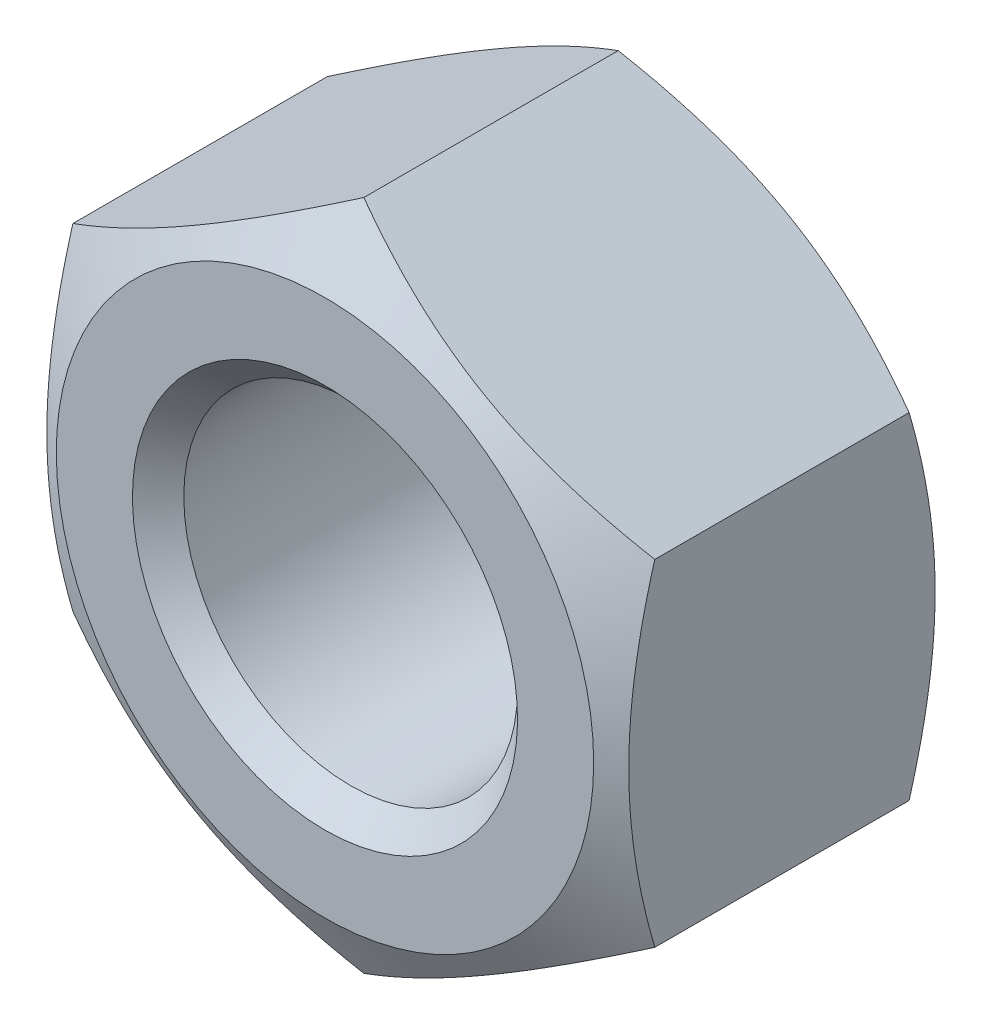
ISO-10303-21;
HEADER;
FILE_DESCRIPTION(('STEP AP214'),'2;1');
FILE_NAME('part.step','',(''),(''),'','','');
FILE_SCHEMA(('AUTOMOTIVE_DESIGN { 1 0 10303 214 1 1 1 1 }'));
ENDSEC;
DATA;
#1=APPLICATION_CONTEXT('core data for automotive mechanical design processes');
#2=APPLICATION_PROTOCOL_DEFINITION('international standard','automotive_design',2000,#1);
#3=PRODUCT_CONTEXT('',#1,'mechanical');
#4=PRODUCT('Part','Part','',(#3));
#5=PRODUCT_RELATED_PRODUCT_CATEGORY('part','',(#4));
#6=PRODUCT_DEFINITION_FORMATION('','',#4);
#7=PRODUCT_DEFINITION_CONTEXT('part definition',#1,'design');
#8=PRODUCT_DEFINITION('design','',#6,#7);
#9=PRODUCT_DEFINITION_SHAPE('','',#8);
#10=(LENGTH_UNIT() NAMED_UNIT(*) SI_UNIT(.MILLI.,.METRE.));
#11=(NAMED_UNIT(*) PLANE_ANGLE_UNIT() SI_UNIT($,.RADIAN.));
#12=(NAMED_UNIT(*) SI_UNIT($,.STERADIAN.) SOLID_ANGLE_UNIT());
#13=UNCERTAINTY_MEASURE_WITH_UNIT(LENGTH_MEASURE(1.E-05),#10,'distance_accuracy_value','');
#14=(GEOMETRIC_REPRESENTATION_CONTEXT(3) GLOBAL_UNCERTAINTY_ASSIGNED_CONTEXT((#13)) GLOBAL_UNIT_ASSIGNED_CONTEXT((#10,
#11,#12)) REPRESENTATION_CONTEXT('',''));
#15=CARTESIAN_POINT('',(0.,0.,0.));
#16=DIRECTION('',(0.,0.,1.));
#17=DIRECTION('',(1.,0.,0.));
#18=AXIS2_PLACEMENT_3D('',#15,#16,#17);
#19=CARTESIAN_POINT('',(0.,0.,0.));
#20=DIRECTION('',(0.,0.,1.));
#21=DIRECTION('',(1.,0.,0.));
#22=AXIS2_PLACEMENT_3D('',#19,#20,#21);
#23=PLANE('',#22);
#24=CARTESIAN_POINT('',(0.,0.,0.));
#25=DIRECTION('',(0.,0.,1.));
#26=DIRECTION('',(0.,-1.,0.));
#27=AXIS2_PLACEMENT_3D('',#24,#25,#26);
#28=CIRCLE('',#27,11.25);
#29=CARTESIAN_POINT('',(0.,-11.25,0.));
#30=VERTEX_POINT('',#29);
#31=EDGE_CURVE('E264',#30,#30,#28,.T.);
#32=ORIENTED_EDGE('',*,*,#31,.F.);
#33=EDGE_LOOP('',(#32));
#34=FACE_BOUND('',#33,.T.);
#35=CARTESIAN_POINT('',(0.,0.,0.));
#36=DIRECTION('',(0.,0.,1.));
#37=DIRECTION('',(1.,0.,0.));
#38=AXIS2_PLACEMENT_3D('',#35,#36,#37);
#39=CIRCLE('',#38,15.7);
#40=CARTESIAN_POINT('',(15.7,0.,0.));
#41=VERTEX_POINT('',#40);
#42=EDGE_CURVE('E223',#41,#41,#39,.T.);
#43=ORIENTED_EDGE('',*,*,#42,.T.);
#44=EDGE_LOOP('',(#43));
#45=FACE_BOUND('',#44,.T.);
#46=ADVANCED_FACE('F36',(#34,#45),#23,.T.);
#47=CARTESIAN_POINT('',(0.,0.,0.));
#48=DIRECTION('',(0.,0.,-1.));
#49=DIRECTION('',(-1.,0.,0.));
#50=AXIS2_PLACEMENT_3D('',#47,#48,#49);
#51=CONICAL_SURFACE('',#50,15.7,1.0471975511966);
#52=CARTESIAN_POINT('',(-17.0002,9.81483910616981,-2.26900077431108));
#53=CARTESIAN_POINT('',(-16.6265469064567,10.0305678203106,-2.14445819023212));
#54=CARTESIAN_POINT('',(-16.251436365233,10.2471379922619,-2.02556713985945));
#55=CARTESIAN_POINT('',(-15.4982073403609,10.6820149725333,-1.80065903466373));
#56=CARTESIAN_POINT('',(-15.1200879107272,10.9003223270181,-1.69464621406476));
#57=CARTESIAN_POINT('',(-14.3601103187305,11.3390955943355,-1.49691959430863));
#58=CARTESIAN_POINT('',(-13.9782455058022,11.5595653468737,-1.40523962826047));
#59=CARTESIAN_POINT('',(-13.2118624748498,12.0020367960964,-1.23814738869012));
#60=CARTESIAN_POINT('',(-12.8273444100892,12.2240384042942,-1.16273418351413));
#61=CARTESIAN_POINT('',(-12.0655075393886,12.6638851266718,-1.03138301007862));
#62=CARTESIAN_POINT('',(-11.6882452921721,12.8816975866573,-0.975010293167007));
#63=CARTESIAN_POINT('',(-10.9319921229911,13.3183205574595,-0.880485850052318));
#64=CARTESIAN_POINT('',(-10.5530011678939,13.5371310874053,-0.842334474574963));
#65=CARTESIAN_POINT('',(-9.79438261780434,13.9751197115118,-0.785216014403568));
#66=CARTESIAN_POINT('',(-9.41475631882947,14.1942970574164,-0.76622613300532));
#67=CARTESIAN_POINT('',(-8.65515330704035,14.6328540607501,-0.747839050498202));
#68=CARTESIAN_POINT('',(-8.27517660541659,14.8522337117183,-0.748441243980961));
#69=CARTESIAN_POINT('',(-7.56480067427073,15.2623694467912,-0.767870053870435));
#70=CARTESIAN_POINT('',(-7.23435083193736,15.4531547522161,-0.784327500506852));
#71=CARTESIAN_POINT('',(-6.57423939634649,15.8342702672496,-0.831747883297576));
#72=CARTESIAN_POINT('',(-6.2445777918682,16.0246004833366,-0.862710611714524));
#73=CARTESIAN_POINT('',(-5.58616773221974,16.4047337085118,-0.938604295800273));
#74=CARTESIAN_POINT('',(-5.25742037514752,16.5945360836128,-0.983547882986054));
#75=CARTESIAN_POINT('',(-4.60149064349035,16.9732372907546,-1.08661020340748));
#76=CARTESIAN_POINT('',(-4.27430826227985,17.1621361266206,-1.14472888081401));
#77=CARTESIAN_POINT('',(-3.281103910772,17.7355629263239,-1.34032568866998));
#78=CARTESIAN_POINT('',(-2.61795816688453,18.1184303000693,-1.4973073879878));
#79=CARTESIAN_POINT('',(-1.30155488695446,18.878456088099,-1.85359145296698));
#80=CARTESIAN_POINT('',(-0.648280497058976,19.2556242329599,-2.05281014623164));
#81=CARTESIAN_POINT('',(0.000200000000001784,19.6300246225011,-2.26900077431108));
#82=B_SPLINE_CURVE_WITH_KNOTS('',3,(#52,#53,#54,#55,#56,#57,#58,#59,#60,#61,#62,#63,#64,#65,#66,
#67,#68,#69,#70,#71,#72,#73,#74,#75,#76,#77,#78,#79,#80,#81),.UNSPECIFIED.,.F.,.F.,(4,2,2,2,2,2,
2,2,2,2,2,2,2,2,4),(0.,1.34725361023886,2.6949489909653,4.04577911356302,5.39653184888179,
6.71394507676439,8.03138366129191,9.34725301563479,10.6630817087628,11.808581597515,
12.9540650814946,14.1005865149997,15.2471030902392,17.590639246696,19.929575477219),.UNSPECIFIED.);
#83=CARTESIAN_POINT('',(-17.,9.81495457622365,-2.26893410705618));
#84=VERTEX_POINT('',#83);
#85=CARTESIAN_POINT('',(0.,19.6299091524473,-2.26893410705618));
#86=VERTEX_POINT('',#85);
#87=EDGE_CURVE('E218',#84,#86,#82,.T.);
#88=ORIENTED_EDGE('',*,*,#87,.F.);
#89=CARTESIAN_POINT('',(-17.,-25.9267472467528,-8.83528627186308));
#90=CARTESIAN_POINT('',(-17.,-25.5539648090977,-8.65530488119288));
#91=CARTESIAN_POINT('',(-17.,-25.1807288184547,-8.47626336943934));
#92=CARTESIAN_POINT('',(-17.,-24.4332538627016,-8.12027608125413));
#93=CARTESIAN_POINT('',(-17.,-24.0590148864408,-7.94333032824134));
#94=CARTESIAN_POINT('',(-17.,-22.9345384288083,-7.41590864060599));
#95=CARTESIAN_POINT('',(-17.,-22.1826644417827,-7.06890784699101));
#96=CARTESIAN_POINT('',(-17.,-20.6693295294818,-6.38442672467381));
#97=CARTESIAN_POINT('',(-17.,-19.9078382964153,-6.04701323457675));
#98=CARTESIAN_POINT('',(-17.,-18.3785592608469,-5.38682372702414));
#99=CARTESIAN_POINT('',(-17.,-17.6107717926793,-5.06404693821717));
#100=CARTESIAN_POINT('',(-17.,-16.0586340457663,-4.43340326623387));
#101=CARTESIAN_POINT('',(-17.,-15.274195004503,-4.12575369084784));
#102=CARTESIAN_POINT('',(-17.,-13.696022043621,-3.53480920182964));
#103=CARTESIAN_POINT('',(-17.,-12.9022870972841,-3.25151700781198));
#104=CARTESIAN_POINT('',(-17.,-11.3059512165511,-2.71697899718527));
#105=CARTESIAN_POINT('',(-17.,-10.5033735966652,-2.46566413029521));
#106=CARTESIAN_POINT('',(-17.,-8.88673603066168,-2.00329800631384));
#107=CARTESIAN_POINT('',(-17.,-8.07267983149313,-1.79223392262732));
#108=CARTESIAN_POINT('',(-17.,-6.84282468382309,-1.51359777047095));
#109=CARTESIAN_POINT('',(-17.,-6.43130091987701,-1.42702780561636));
#110=CARTESIAN_POINT('',(-17.,-5.60553570443179,-1.26792169073959));
#111=CARTESIAN_POINT('',(-17.,-5.19129431536871,-1.19538521946428));
#112=CARTESIAN_POINT('',(-17.,-4.36037948024351,-1.06563790696937));
#113=CARTESIAN_POINT('',(-17.,-3.94370588240015,-1.00842803287828));
#114=CARTESIAN_POINT('',(-17.,-3.10841242547604,-0.910486373547461));
#115=CARTESIAN_POINT('',(-17.,-2.68979256380067,-0.869754610281469));
#116=CARTESIAN_POINT('',(-17.,-1.85381375994843,-0.805860178374631));
#117=CARTESIAN_POINT('',(-17.,-1.43646307035987,-0.782590240303972));
#118=CARTESIAN_POINT('',(-17.,-0.601153044712188,-0.753740168759731));
#119=CARTESIAN_POINT('',(-17.,-0.183193717826098,-0.748159771384462));
#120=CARTESIAN_POINT('',(-17.,0.652471507108319,-0.754820619047691));
#121=CARTESIAN_POINT('',(-17.,1.070177443126,-0.767057044362938));
#122=CARTESIAN_POINT('',(-17.,1.90470927270493,-0.809050414750458));
#123=CARTESIAN_POINT('',(-17.,2.32153512661024,-0.838808133097964));
#124=CARTESIAN_POINT('',(-17.,3.33484820370525,-0.931831324455307));
#125=CARTESIAN_POINT('',(-17.,3.93052966291356,-1.00404527837153));
#126=CARTESIAN_POINT('',(-17.,5.11715583192569,-1.18021128874136));
#127=CARTESIAN_POINT('',(-17.,5.7080998115513,-1.28416814469026));
#128=CARTESIAN_POINT('',(-17.,7.47489110533387,-1.63843047027764));
#129=CARTESIAN_POINT('',(-17.,8.64238042158542,-1.9308880733226));
#130=CARTESIAN_POINT('',(-17.,10.3885450516742,-2.43429179450095));
#131=CARTESIAN_POINT('',(-17.,10.9763653928662,-2.61530716784065));
#132=CARTESIAN_POINT('',(-17.,12.1463268837286,-2.99516492515156));
#133=CARTESIAN_POINT('',(-17.,12.7284675203987,-3.19400890320246));
#134=CARTESIAN_POINT('',(-17.,13.8841642605752,-3.60530371093944));
#135=CARTESIAN_POINT('',(-17.,14.4577503102576,-3.81767110050551));
#136=CARTESIAN_POINT('',(-17.,15.3145292969767,-4.14530846477523));
#137=CARTESIAN_POINT('',(-17.,15.5994765967891,-4.25601670616324));
#138=CARTESIAN_POINT('',(-17.,16.1682685205824,-4.48021558039378));
#139=CARTESIAN_POINT('',(-17.,16.4521131659655,-4.59370615891639));
#140=CARTESIAN_POINT('',(-17.,16.735444987615,-4.70846199828913));
#141=B_SPLINE_CURVE_WITH_KNOTS('',3,(#89,#90,#91,#92,#93,#94,#95,#96,#97,#98,#99,#100,#101,#102,
#103,#104,#105,#106,#107,#108,#109,#110,#111,#112,#113,#114,#115,#116,#117,#118,#119,#120,#121,
#122,#123,#124,#125,#126,#127,#128,#129,#130,#131,#132,#133,#134,#135,#136,#137,#138,#139,#140),
.UNSPECIFIED.,.F.,.F.,(4,2,2,2,2,2,2,2,2,2,2,2,2,2,2,2,2,2,2,2,2,2,2,2,2,4),(0.,
1.24186727211345,2.48374840829803,4.96792071543007,7.46649146485291,9.96493038667426,
12.4924537659258,15.0202589893835,17.5425096574214,20.0639552194549,21.3253468534078,
22.5867096083098,23.8481519381283,25.1095959500881,26.3632259008802,27.6168371492864,
28.8701093396594,30.1234368454131,31.9225406006737,33.721916513448,37.3276264552829,
39.1726660852152,41.0178708474609,42.8526253217389,43.7697066959693,44.6867701801409),.UNSPECIFIED.);
#142=CARTESIAN_POINT('',(-17.,-9.81495457622364,-2.26893410705618));
#143=VERTEX_POINT('',#142);
#144=EDGE_CURVE('E186',#143,#84,#141,.T.);
#145=ORIENTED_EDGE('',*,*,#144,.F.);
#146=CARTESIAN_POINT('',(0.000199999999992894,-19.6300246225011,-2.26900077431108));
#147=CARTESIAN_POINT('',(-0.373453093543291,-19.4142959083604,-2.14445819023212));
#148=CARTESIAN_POINT('',(-0.748563634767014,-19.197725736409,-2.02556713985945));
#149=CARTESIAN_POINT('',(-1.50179265963909,-18.7628487561377,-1.80065903466373));
#150=CARTESIAN_POINT('',(-1.87991208927283,-18.5445414016528,-1.69464621406476));
#151=CARTESIAN_POINT('',(-2.63988968126951,-18.1057681343354,-1.49691959430863));
#152=CARTESIAN_POINT('',(-3.02175449419786,-17.8852983817972,-1.40523962826047));
#153=CARTESIAN_POINT('',(-3.78813752515018,-17.4428269325745,-1.23814738869012));
#154=CARTESIAN_POINT('',(-4.1726555899108,-17.2208253243767,-1.16273418351413));
#155=CARTESIAN_POINT('',(-4.93449246061139,-16.7809786019991,-1.03138301007862));
#156=CARTESIAN_POINT('',(-5.31175470782787,-16.5631661420136,-0.975010293167006));
#157=CARTESIAN_POINT('',(-6.06800787700895,-16.1265431712114,-0.880485850052319));
#158=CARTESIAN_POINT('',(-6.44699883210612,-15.9077326412656,-0.842334474574963));
#159=CARTESIAN_POINT('',(-7.20561738219567,-15.4697440171592,-0.785216014403568));
#160=CARTESIAN_POINT('',(-7.58524368117054,-15.2505666712546,-0.766226133005319));
#161=CARTESIAN_POINT('',(-8.34484669295967,-14.8120096679209,-0.747839050498201));
#162=CARTESIAN_POINT('',(-8.72482339458342,-14.5926300169526,-0.748441243980961));
#163=CARTESIAN_POINT('',(-9.43519932572928,-14.1824942818797,-0.767870053870435));
#164=CARTESIAN_POINT('',(-9.76564916806265,-13.9917089764549,-0.784327500506851));
#165=CARTESIAN_POINT('',(-10.4257606036535,-13.6105934614213,-0.831747883297576));
#166=CARTESIAN_POINT('',(-10.7554222081318,-13.4202632453343,-0.862710611714525));
#167=CARTESIAN_POINT('',(-11.4138322677803,-13.0401300201591,-0.938604295800274));
#168=CARTESIAN_POINT('',(-11.7425796248525,-12.8503276450581,-0.983547882986055));
#169=CARTESIAN_POINT('',(-12.3985093565097,-12.4716264379163,-1.08661020340748));
#170=CARTESIAN_POINT('',(-12.7256917377202,-12.2827276020504,-1.14472888081401));
#171=CARTESIAN_POINT('',(-13.718896089228,-11.709300802347,-1.34032568866998));
#172=CARTESIAN_POINT('',(-14.3820418331155,-11.3264334286016,-1.4973073879878));
#173=CARTESIAN_POINT('',(-15.6984451130455,-10.5664076405719,-1.85359145296698));
#174=CARTESIAN_POINT('',(-16.351719502941,-10.189239495711,-2.05281014623164));
#175=CARTESIAN_POINT('',(-17.0002,-9.8148391061698,-2.26900077431108));
#176=B_SPLINE_CURVE_WITH_KNOTS('',3,(#146,#147,#148,#149,#150,#151,#152,#153,#154,#155,#156,
#157,#158,#159,#160,#161,#162,#163,#164,#165,#166,#167,#168,#169,#170,#171,#172,#173,#174,#175),
.UNSPECIFIED.,.F.,.F.,(4,2,2,2,2,2,2,2,2,2,2,2,2,2,4),(0.,1.34725361023886,2.6949489909653,
4.04577911356303,5.39653184888179,6.71394507676439,8.0313836612919,9.34725301563479,
10.6630817087628,11.808581597515,12.9540650814946,14.1005865149997,15.2471030902392,
17.590639246696,19.929575477219),.UNSPECIFIED.);
#177=CARTESIAN_POINT('',(0.,-19.6299091524473,-2.26893410705618));
#178=VERTEX_POINT('',#177);
#179=EDGE_CURVE('E178',#178,#143,#176,.T.);
#180=ORIENTED_EDGE('',*,*,#179,.F.);
#181=CARTESIAN_POINT('',(17.0002,-9.81483910616981,-2.26900077431107));
#182=CARTESIAN_POINT('',(16.6265469064567,-10.0305678203106,-2.14445819023211));
#183=CARTESIAN_POINT('',(16.251436365233,-10.2471379922619,-2.02556713985945));
#184=CARTESIAN_POINT('',(15.4982073403609,-10.6820149725333,-1.80065903466373));
#185=CARTESIAN_POINT('',(15.1200879107272,-10.9003223270181,-1.69464621406476));
#186=CARTESIAN_POINT('',(14.3601103187305,-11.3390955943355,-1.49691959430862));
#187=CARTESIAN_POINT('',(13.9782455058021,-11.5595653468737,-1.40523962826047));
#188=CARTESIAN_POINT('',(13.2118624748498,-12.0020367960964,-1.23814738869011));
#189=CARTESIAN_POINT('',(12.8273444100892,-12.2240384042942,-1.16273418351412));
#190=CARTESIAN_POINT('',(12.0655075393886,-12.6638851266718,-1.03138301007861));
#191=CARTESIAN_POINT('',(11.6882452921721,-12.8816975866573,-0.975010293167003));
#192=CARTESIAN_POINT('',(10.931992122991,-13.3183205574595,-0.880485850052316));
#193=CARTESIAN_POINT('',(10.5530011678939,-13.5371310874053,-0.84233447457496));
#194=CARTESIAN_POINT('',(9.79438261780433,-13.9751197115118,-0.785216014403565));
#195=CARTESIAN_POINT('',(9.41475631882946,-14.1942970574164,-0.766226133005318));
#196=CARTESIAN_POINT('',(8.65515330704033,-14.6328540607501,-0.747839050498201));
#197=CARTESIAN_POINT('',(8.27517660541658,-14.8522337117183,-0.748441243980961));
#198=CARTESIAN_POINT('',(7.56480067427072,-15.2623694467912,-0.767870053870435));
#199=CARTESIAN_POINT('',(7.23435083193735,-15.4531547522161,-0.784327500506851));
#200=CARTESIAN_POINT('',(6.57423939634648,-15.8342702672496,-0.831747883297575));
#201=CARTESIAN_POINT('',(6.2445777918682,-16.0246004833366,-0.862710611714522));
#202=CARTESIAN_POINT('',(5.58616773221973,-16.4047337085118,-0.938604295800271));
#203=CARTESIAN_POINT('',(5.25742037514752,-16.5945360836128,-0.983547882986052));
#204=CARTESIAN_POINT('',(4.60149064349034,-16.9732372907546,-1.08661020340748));
#205=CARTESIAN_POINT('',(4.27430826227984,-17.1621361266206,-1.14472888081401));
#206=CARTESIAN_POINT('',(3.28110391077199,-17.7355629263239,-1.34032568866998));
#207=CARTESIAN_POINT('',(2.61795816688453,-18.1184303000693,-1.4973073879878));
#208=CARTESIAN_POINT('',(1.30155488695446,-18.878456088099,-1.85359145296698));
#209=CARTESIAN_POINT('',(0.648280497058971,-19.2556242329599,-2.05281014623164));
#210=CARTESIAN_POINT('',(-0.000200000000007482,-19.6300246225011,-2.26900077431108));
#211=B_SPLINE_CURVE_WITH_KNOTS('',3,(#181,#182,#183,#184,#185,#186,#187,#188,#189,#190,#191,
#192,#193,#194,#195,#196,#197,#198,#199,#200,#201,#202,#203,#204,#205,#206,#207,#208,#209,#210),
.UNSPECIFIED.,.F.,.F.,(4,2,2,2,2,2,2,2,2,2,2,2,2,2,4),(0.,1.34725361023886,2.6949489909653,
4.04577911356302,5.39653184888179,6.71394507676438,8.0313836612919,9.34725301563479,
10.6630817087628,11.808581597515,12.9540650814946,14.1005865149997,15.2471030902392,
17.590639246696,19.929575477219),.UNSPECIFIED.);
#212=CARTESIAN_POINT('',(17.,-9.81495457622364,-2.26893410705618));
#213=VERTEX_POINT('',#212);
#214=EDGE_CURVE('E94',#213,#178,#211,.T.);
#215=ORIENTED_EDGE('',*,*,#214,.F.);
#216=CARTESIAN_POINT('',(17.,-25.9267472467528,-8.83528627186308));
#217=CARTESIAN_POINT('',(17.,-25.5539648090977,-8.65530488119288));
#218=CARTESIAN_POINT('',(17.,-25.1807288184547,-8.47626336943934));
#219=CARTESIAN_POINT('',(17.,-24.4332538627016,-8.12027608125413));
#220=CARTESIAN_POINT('',(17.,-24.0590148864408,-7.94333032824134));
#221=CARTESIAN_POINT('',(17.,-22.9345384288083,-7.41590864060598));
#222=CARTESIAN_POINT('',(17.,-22.1826644417827,-7.06890784699101));
#223=CARTESIAN_POINT('',(17.,-20.6693295294818,-6.38442672467381));
#224=CARTESIAN_POINT('',(17.,-19.9078382964153,-6.04701323457675));
#225=CARTESIAN_POINT('',(17.,-18.3785592608469,-5.38682372702413));
#226=CARTESIAN_POINT('',(17.,-17.6107717926793,-5.06404693821717));
#227=CARTESIAN_POINT('',(17.,-16.0586340457663,-4.43340326623387));
#228=CARTESIAN_POINT('',(17.,-15.274195004503,-4.12575369084784));
#229=CARTESIAN_POINT('',(17.,-13.696022043621,-3.53480920182964));
#230=CARTESIAN_POINT('',(17.,-12.9022870972841,-3.25151700781198));
#231=CARTESIAN_POINT('',(17.,-11.3059512165511,-2.71697899718527));
#232=CARTESIAN_POINT('',(17.,-10.5033735966652,-2.4656641302952));
#233=CARTESIAN_POINT('',(17.,-8.88673603066168,-2.00329800631384));
#234=CARTESIAN_POINT('',(17.,-8.07267983149313,-1.79223392262732));
#235=CARTESIAN_POINT('',(17.,-6.84282468382309,-1.51359777047094));
#236=CARTESIAN_POINT('',(17.,-6.43130091987702,-1.42702780561635));
#237=CARTESIAN_POINT('',(17.,-5.6055357044318,-1.26792169073958));
#238=CARTESIAN_POINT('',(17.,-5.19129431536872,-1.19538521946427));
#239=CARTESIAN_POINT('',(17.,-4.36037948024352,-1.06563790696937));
#240=CARTESIAN_POINT('',(17.,-3.94370588240016,-1.00842803287828));
#241=CARTESIAN_POINT('',(17.,-3.10841242547605,-0.910486373547459));
#242=CARTESIAN_POINT('',(17.,-2.68979256380068,-0.869754610281466));
#243=CARTESIAN_POINT('',(17.,-1.85381375994844,-0.805860178374626));
#244=CARTESIAN_POINT('',(17.,-1.43646307035988,-0.782590240303966));
#245=CARTESIAN_POINT('',(17.,-0.601153044712196,-0.753740168759725));
#246=CARTESIAN_POINT('',(17.,-0.183193717826106,-0.748159771384455));
#247=CARTESIAN_POINT('',(17.,0.65247150710831,-0.754820619047686));
#248=CARTESIAN_POINT('',(17.,1.07017744312599,-0.767057044362933));
#249=CARTESIAN_POINT('',(17.,1.90470927270492,-0.809050414750454));
#250=CARTESIAN_POINT('',(17.,2.32153512661023,-0.838808133097959));
#251=CARTESIAN_POINT('',(17.,3.33484820370524,-0.9318313244553));
#252=CARTESIAN_POINT('',(17.,3.93052966291355,-1.00404527837152));
#253=CARTESIAN_POINT('',(17.,5.11715583192568,-1.18021128874135));
#254=CARTESIAN_POINT('',(17.,5.70809981155129,-1.28416814469026));
#255=CARTESIAN_POINT('',(17.,7.47489110533385,-1.63843047027763));
#256=CARTESIAN_POINT('',(17.,8.6423804215854,-1.93088807332259));
#257=CARTESIAN_POINT('',(17.,10.3885450516742,-2.43429179450094));
#258=CARTESIAN_POINT('',(17.,10.9763653928662,-2.61530716784064));
#259=CARTESIAN_POINT('',(17.,12.1463268837285,-2.99516492515155));
#260=CARTESIAN_POINT('',(17.,12.7284675203987,-3.19400890320245));
#261=CARTESIAN_POINT('',(17.,13.8841642605752,-3.60530371093943));
#262=CARTESIAN_POINT('',(17.,14.4577503102576,-3.8176711005055));
#263=CARTESIAN_POINT('',(17.,15.3145292969767,-4.14530846477522));
#264=CARTESIAN_POINT('',(17.,15.5994765967891,-4.25601670616323));
#265=CARTESIAN_POINT('',(17.,16.1682685205824,-4.48021558039377));
#266=CARTESIAN_POINT('',(17.,16.4521131659654,-4.59370615891638));
#267=CARTESIAN_POINT('',(17.,16.735444987615,-4.70846199828912));
#268=B_SPLINE_CURVE_WITH_KNOTS('',3,(#216,#217,#218,#219,#220,#221,#222,#223,#224,#225,#226,
#227,#228,#229,#230,#231,#232,#233,#234,#235,#236,#237,#238,#239,#240,#241,#242,#243,#244,#245,
#246,#247,#248,#249,#250,#251,#252,#253,#254,#255,#256,#257,#258,#259,#260,#261,#262,#263,#264,
#265,#266,#267),.UNSPECIFIED.,.F.,.F.,(4,2,2,2,2,2,2,2,2,2,2,2,2,2,2,2,2,2,2,2,2,2,2,2,2,4),(0.,
1.24186727211345,2.48374840829802,4.96792071543007,7.4664914648529,9.96493038667426,
12.4924537659258,15.0202589893835,17.5425096574214,20.0639552194549,21.3253468534078,
22.5867096083098,23.8481519381283,25.1095959500881,26.3632259008801,27.6168371492863,
28.8701093396594,30.123436845413,31.9225406006737,33.721916513448,37.3276264552828,
39.1726660852152,41.0178708474609,42.8526253217388,43.7697066959693,44.6867701801409),.UNSPECIFIED.);
#269=CARTESIAN_POINT('',(17.,9.81495457622366,-2.26893410705618));
#270=VERTEX_POINT('',#269);
#271=EDGE_CURVE('E90',#270,#213,#268,.F.);
#272=ORIENTED_EDGE('',*,*,#271,.F.);
#273=CARTESIAN_POINT('',(-0.00019999999999798,19.6300246225011,-2.26900077431108));
#274=CARTESIAN_POINT('',(0.373453093543288,19.4142959083604,-2.14445819023211));
#275=CARTESIAN_POINT('',(0.748563634767011,19.197725736409,-2.02556713985945));
#276=CARTESIAN_POINT('',(1.50179265963908,18.7628487561377,-1.80065903466373));
#277=CARTESIAN_POINT('',(1.87991208927282,18.5445414016528,-1.69464621406476));
#278=CARTESIAN_POINT('',(2.63988968126951,18.1057681343354,-1.49691959430863));
#279=CARTESIAN_POINT('',(3.02175449419785,17.8852983817972,-1.40523962826047));
#280=CARTESIAN_POINT('',(3.78813752515018,17.4428269325745,-1.23814738869011));
#281=CARTESIAN_POINT('',(4.1726555899108,17.2208253243767,-1.16273418351413));
#282=CARTESIAN_POINT('',(4.93449246061139,16.7809786019991,-1.03138301007862));
#283=CARTESIAN_POINT('',(5.31175470782786,16.5631661420136,-0.975010293167004));
#284=CARTESIAN_POINT('',(6.06800787700895,16.1265431712114,-0.880485850052316));
#285=CARTESIAN_POINT('',(6.44699883210612,15.9077326412656,-0.842334474574962));
#286=CARTESIAN_POINT('',(7.20561738219567,15.4697440171592,-0.785216014403569));
#287=CARTESIAN_POINT('',(7.58524368117054,15.2505666712546,-0.76622613300532));
#288=CARTESIAN_POINT('',(8.34484669295966,14.8120096679209,-0.747839050498202));
#289=CARTESIAN_POINT('',(8.72482339458342,14.5926300169526,-0.748441243980961));
#290=CARTESIAN_POINT('',(9.43519932572927,14.1824942818797,-0.767870053870435));
#291=CARTESIAN_POINT('',(9.76564916806265,13.9917089764549,-0.784327500506851));
#292=CARTESIAN_POINT('',(10.4257606036535,13.6105934614213,-0.831747883297575));
#293=CARTESIAN_POINT('',(10.7554222081318,13.4202632453343,-0.862710611714522));
#294=CARTESIAN_POINT('',(11.4138322677803,13.0401300201591,-0.938604295800271));
#295=CARTESIAN_POINT('',(11.7425796248525,12.8503276450581,-0.983547882986052));
#296=CARTESIAN_POINT('',(12.3985093565096,12.4716264379163,-1.08661020340748));
#297=CARTESIAN_POINT('',(12.7256917377201,12.2827276020504,-1.14472888081401));
#298=CARTESIAN_POINT('',(13.718896089228,11.709300802347,-1.34032568866998));
#299=CARTESIAN_POINT('',(14.3820418331155,11.3264334286016,-1.49730738798779));
#300=CARTESIAN_POINT('',(15.6984451130455,10.5664076405719,-1.85359145296697));
#301=CARTESIAN_POINT('',(16.351719502941,10.189239495711,-2.05281014623164));
#302=CARTESIAN_POINT('',(17.0002,9.81483910616981,-2.26900077431108));
#303=B_SPLINE_CURVE_WITH_KNOTS('',3,(#273,#274,#275,#276,#277,#278,#279,#280,#281,#282,#283,
#284,#285,#286,#287,#288,#289,#290,#291,#292,#293,#294,#295,#296,#297,#298,#299,#300,#301,#302),
.UNSPECIFIED.,.F.,.F.,(4,2,2,2,2,2,2,2,2,2,2,2,2,2,4),(0.,1.34725361023886,2.6949489909653,
4.04577911356303,5.39653184888179,6.71394507676439,8.0313836612919,9.34725301563479,
10.6630817087628,11.808581597515,12.9540650814946,14.1005865149997,15.2471030902392,
17.590639246696,19.929575477219),.UNSPECIFIED.);
#304=EDGE_CURVE('E62',#86,#270,#303,.T.);
#305=ORIENTED_EDGE('',*,*,#304,.F.);
#306=EDGE_LOOP('',(#88,#145,#180,#215,#272,#305));
#307=FACE_BOUND('',#306,.T.);
#308=ORIENTED_EDGE('',*,*,#42,.F.);
#309=EDGE_LOOP('',(#308));
#310=FACE_BOUND('',#309,.T.);
#311=ADVANCED_FACE('F91',(#307,#310),#51,.T.);
#312=CARTESIAN_POINT('',(17.,9.81495457622365,-19.4));
#313=DIRECTION('',(0.5,0.866025403784439,0.));
#314=DIRECTION('',(-0.866025403784439,0.5,0.));
#315=AXIS2_PLACEMENT_3D('',#312,#313,#314);
#316=PLANE('',#315);
#317=DIRECTION('',(0.,0.,1.));
#318=VECTOR('',#317,1.);
#319=CARTESIAN_POINT('',(17.,9.81495457622365,-19.4));
#320=LINE('',#319,#318);
#321=CARTESIAN_POINT('',(17.,9.81495457622366,-17.1310658929438));
#322=VERTEX_POINT('',#321);
#323=EDGE_CURVE('E11',#322,#270,#320,.T.);
#324=ORIENTED_EDGE('',*,*,#323,.F.);
#325=CARTESIAN_POINT('',(17.0002,9.81483910616981,-17.1309992256889));
#326=CARTESIAN_POINT('',(16.6265469064567,10.0305678203106,-17.2555418097679));
#327=CARTESIAN_POINT('',(16.251436365233,10.2471379922619,-17.3744328601406));
#328=CARTESIAN_POINT('',(15.4982073403609,10.6820149725333,-17.5993409653363));
#329=CARTESIAN_POINT('',(15.1200879107272,10.9003223270181,-17.7053537859352));
#330=CARTESIAN_POINT('',(14.3601103187305,11.3390955943355,-17.9030804056914));
#331=CARTESIAN_POINT('',(13.9782455058021,11.5595653468737,-17.9947603717395));
#332=CARTESIAN_POINT('',(13.2118624748498,12.0020367960964,-18.1618526113099));
#333=CARTESIAN_POINT('',(12.8273444100892,12.2240384042942,-18.2372658164859));
#334=CARTESIAN_POINT('',(12.0655075393886,12.6638851266718,-18.3686169899214));
#335=CARTESIAN_POINT('',(11.6882452921721,12.8816975866573,-18.424989706833));
#336=CARTESIAN_POINT('',(10.931992122991,13.3183205574595,-18.5195141499477));
#337=CARTESIAN_POINT('',(10.5530011678939,13.5371310874053,-18.557665525425));
#338=CARTESIAN_POINT('',(9.79438261780433,13.9751197115118,-18.6147839855964));
#339=CARTESIAN_POINT('',(9.41475631882946,14.1942970574164,-18.6337738669947));
#340=CARTESIAN_POINT('',(8.65515330704034,14.6328540607501,-18.6521609495018));
#341=CARTESIAN_POINT('',(8.27517660541658,14.8522337117183,-18.651558756019));
#342=CARTESIAN_POINT('',(7.56480067427072,15.2623694467912,-18.6321299461296));
#343=CARTESIAN_POINT('',(7.23435083193735,15.4531547522161,-18.6156724994931));
#344=CARTESIAN_POINT('',(6.57423939634648,15.8342702672496,-18.5682521167024));
#345=CARTESIAN_POINT('',(6.2445777918682,16.0246004833366,-18.5372893882855));
#346=CARTESIAN_POINT('',(5.58616773221973,16.4047337085118,-18.4613957041997));
#347=CARTESIAN_POINT('',(5.25742037514752,16.5945360836128,-18.4164521170139));
#348=CARTESIAN_POINT('',(4.60149064349035,16.9732372907546,-18.3133897965925));
#349=CARTESIAN_POINT('',(4.27430826227985,17.1621361266206,-18.255271119186));
#350=CARTESIAN_POINT('',(3.281103910772,17.7355629263239,-18.05967431133));
#351=CARTESIAN_POINT('',(2.61795816688453,18.1184303000693,-17.9026926120122));
#352=CARTESIAN_POINT('',(1.30155488695446,18.878456088099,-17.546408547033));
#353=CARTESIAN_POINT('',(0.648280497058978,19.2556242329599,-17.3471898537684));
#354=CARTESIAN_POINT('',(-0.000199999999998876,19.6300246225011,-17.1309992256889));
#355=B_SPLINE_CURVE_WITH_KNOTS('',3,(#325,#326,#327,#328,#329,#330,#331,#332,#333,#334,#335,
#336,#337,#338,#339,#340,#341,#342,#343,#344,#345,#346,#347,#348,#349,#350,#351,#352,#353,#354),
.UNSPECIFIED.,.F.,.F.,(4,2,2,2,2,2,2,2,2,2,2,2,2,2,4),(0.,1.34725361023886,2.6949489909653,
4.04577911356302,5.39653184888179,6.71394507676438,8.0313836612919,9.34725301563478,
10.6630817087628,11.808581597515,12.9540650814946,14.1005865149997,15.2471030902392,
17.590639246696,19.929575477219),.UNSPECIFIED.);
#356=CARTESIAN_POINT('',(0.,19.6299091524473,-17.1310658929438));
#357=VERTEX_POINT('',#356);
#358=EDGE_CURVE('E110',#322,#357,#355,.T.);
#359=ORIENTED_EDGE('',*,*,#358,.T.);
#360=DIRECTION('',(0.,0.,1.));
#361=VECTOR('',#360,1.);
#362=CARTESIAN_POINT('',(0.,19.6299091524473,-19.4));
#363=LINE('',#362,#361);
#364=EDGE_CURVE('E41',#357,#86,#363,.T.);
#365=ORIENTED_EDGE('',*,*,#364,.T.);
#366=ORIENTED_EDGE('',*,*,#304,.T.);
#367=EDGE_LOOP('',(#324,#359,#365,#366));
#368=FACE_BOUND('',#367,.T.);
#369=ADVANCED_FACE('F38',(#368),#316,.T.);
#370=CARTESIAN_POINT('',(17.,-9.81495457622365,-19.4));
#371=DIRECTION('',(1.,0.,0.));
#372=DIRECTION('',(0.,0.,-1.));
#373=AXIS2_PLACEMENT_3D('',#370,#371,#372);
#374=PLANE('',#373);
#375=DIRECTION('',(0.,0.,1.));
#376=VECTOR('',#375,1.);
#377=CARTESIAN_POINT('',(17.,-9.81495457622365,-19.4));
#378=LINE('',#377,#376);
#379=CARTESIAN_POINT('',(17.,-9.81495457622364,-17.1310658929438));
#380=VERTEX_POINT('',#379);
#381=EDGE_CURVE('E46',#380,#213,#378,.T.);
#382=ORIENTED_EDGE('',*,*,#381,.F.);
#383=CARTESIAN_POINT('',(17.,-25.9267472467528,-10.5647137281369));
#384=CARTESIAN_POINT('',(17.,-25.5539648090977,-10.7446951188071));
#385=CARTESIAN_POINT('',(17.,-25.1807288184547,-10.9237366305607));
#386=CARTESIAN_POINT('',(17.,-24.4332538627016,-11.2797239187459));
#387=CARTESIAN_POINT('',(17.,-24.0590148864408,-11.4566696717587));
#388=CARTESIAN_POINT('',(17.,-22.9345384288083,-11.984091359394));
#389=CARTESIAN_POINT('',(17.,-22.1826644417827,-12.331092153009));
#390=CARTESIAN_POINT('',(17.,-20.6693295294818,-13.0155732753262));
#391=CARTESIAN_POINT('',(17.,-19.9078382964153,-13.3529867654232));
#392=CARTESIAN_POINT('',(17.,-18.3785592608469,-14.0131762729759));
#393=CARTESIAN_POINT('',(17.,-17.6107717926793,-14.3359530617828));
#394=CARTESIAN_POINT('',(17.,-16.0586340457663,-14.9665967337661));
#395=CARTESIAN_POINT('',(17.,-15.274195004503,-15.2742463091522));
#396=CARTESIAN_POINT('',(17.,-13.696022043621,-15.8651907981704));
#397=CARTESIAN_POINT('',(17.,-12.9022870972841,-16.148482992188));
#398=CARTESIAN_POINT('',(17.,-11.3059512165511,-16.6830210028147));
#399=CARTESIAN_POINT('',(17.,-10.5033735966652,-16.9343358697048));
#400=CARTESIAN_POINT('',(17.,-8.88673603066168,-17.3967019936862));
#401=CARTESIAN_POINT('',(17.,-8.07267983149313,-17.6077660773727));
#402=CARTESIAN_POINT('',(17.,-6.84282468382309,-17.8864022295291));
#403=CARTESIAN_POINT('',(17.,-6.43130091987702,-17.9729721943836));
#404=CARTESIAN_POINT('',(17.,-5.6055357044318,-18.1320783092604));
#405=CARTESIAN_POINT('',(17.,-5.19129431536872,-18.2046147805357));
#406=CARTESIAN_POINT('',(17.,-4.36037948024351,-18.3343620930306));
#407=CARTESIAN_POINT('',(17.,-3.94370588240016,-18.3915719671217));
#408=CARTESIAN_POINT('',(17.,-3.10841242547604,-18.4895136264525));
#409=CARTESIAN_POINT('',(17.,-2.68979256380068,-18.5302453897185));
#410=CARTESIAN_POINT('',(17.,-1.85381375994844,-18.5941398216254));
#411=CARTESIAN_POINT('',(17.,-1.43646307035988,-18.617409759696));
#412=CARTESIAN_POINT('',(17.,-0.601153044712196,-18.6462598312403));
#413=CARTESIAN_POINT('',(17.,-0.183193717826106,-18.6518402286155));
#414=CARTESIAN_POINT('',(17.,0.65247150710831,-18.6451793809523));
#415=CARTESIAN_POINT('',(17.,1.07017744312599,-18.6329429556371));
#416=CARTESIAN_POINT('',(17.,1.90470927270493,-18.5909495852495));
#417=CARTESIAN_POINT('',(17.,2.32153512661023,-18.561191866902));
#418=CARTESIAN_POINT('',(17.,3.33484820370524,-18.4681686755447));
#419=CARTESIAN_POINT('',(17.,3.93052966291355,-18.3959547216285));
#420=CARTESIAN_POINT('',(17.,5.11715583192568,-18.2197887112586));
#421=CARTESIAN_POINT('',(17.,5.70809981155128,-18.1158318553097));
#422=CARTESIAN_POINT('',(17.,7.47489110533385,-17.7615695297224));
#423=CARTESIAN_POINT('',(17.,8.64238042158541,-17.4691119266774));
#424=CARTESIAN_POINT('',(17.,10.3885450516742,-16.9657082054991));
#425=CARTESIAN_POINT('',(17.,10.9763653928662,-16.7846928321594));
#426=CARTESIAN_POINT('',(17.,12.1463268837285,-16.4048350748484));
#427=CARTESIAN_POINT('',(17.,12.7284675203987,-16.2059910967975));
#428=CARTESIAN_POINT('',(17.,13.8841642605752,-15.7946962890606));
#429=CARTESIAN_POINT('',(17.,14.4577503102576,-15.5823288994945));
#430=CARTESIAN_POINT('',(17.,15.3145292969767,-15.2546915352248));
#431=CARTESIAN_POINT('',(17.,15.5994765967891,-15.1439832938368));
#432=CARTESIAN_POINT('',(17.,16.1682685205824,-14.9197844196062));
#433=CARTESIAN_POINT('',(17.,16.4521131659654,-14.8062938410836));
#434=CARTESIAN_POINT('',(17.,16.735444987615,-14.6915380017109));
#435=B_SPLINE_CURVE_WITH_KNOTS('',3,(#383,#384,#385,#386,#387,#388,#389,#390,#391,#392,#393,
#394,#395,#396,#397,#398,#399,#400,#401,#402,#403,#404,#405,#406,#407,#408,#409,#410,#411,#412,
#413,#414,#415,#416,#417,#418,#419,#420,#421,#422,#423,#424,#425,#426,#427,#428,#429,#430,#431,
#432,#433,#434),.UNSPECIFIED.,.F.,.F.,(4,2,2,2,2,2,2,2,2,2,2,2,2,2,2,2,2,2,2,2,2,2,2,2,2,4),(0.,
1.24186727211345,2.48374840829802,4.96792071543007,7.4664914648529,9.96493038667426,
12.4924537659258,15.0202589893835,17.5425096574214,20.0639552194549,21.3253468534078,
22.5867096083098,23.8481519381283,25.1095959500881,26.3632259008802,27.6168371492864,
28.8701093396594,30.123436845413,31.9225406006737,33.721916513448,37.3276264552828,
39.1726660852152,41.0178708474609,42.8526253217388,43.7697066959693,44.6867701801409),.UNSPECIFIED.);
#436=EDGE_CURVE('E108',#380,#322,#435,.T.);
#437=ORIENTED_EDGE('',*,*,#436,.T.);
#438=ORIENTED_EDGE('',*,*,#323,.T.);
#439=ORIENTED_EDGE('',*,*,#271,.T.);
#440=EDGE_LOOP('',(#382,#437,#438,#439));
#441=FACE_BOUND('',#440,.T.);
#442=ADVANCED_FACE('F107',(#441),#374,.T.);
#443=CARTESIAN_POINT('',(0.,-19.6299091524473,-19.4));
#444=DIRECTION('',(0.5,-0.866025403784439,0.));
#445=DIRECTION('',(0.866025403784439,0.5,0.));
#446=AXIS2_PLACEMENT_3D('',#443,#444,#445);
#447=PLANE('',#446);
#448=DIRECTION('',(0.,0.,1.));
#449=VECTOR('',#448,1.);
#450=CARTESIAN_POINT('',(0.,-19.6299091524473,-19.4));
#451=LINE('',#450,#449);
#452=CARTESIAN_POINT('',(0.,-19.6299091524473,-17.1310658929438));
#453=VERTEX_POINT('',#452);
#454=EDGE_CURVE('E207',#453,#178,#451,.T.);
#455=ORIENTED_EDGE('',*,*,#454,.F.);
#456=CARTESIAN_POINT('',(-0.000200000000007421,-19.6300246225011,-17.1309992256889));
#457=CARTESIAN_POINT('',(0.373453093543278,-19.4142959083604,-17.2555418097679));
#458=CARTESIAN_POINT('',(0.748563634767001,-19.197725736409,-17.3744328601405));
#459=CARTESIAN_POINT('',(1.50179265963907,-18.7628487561377,-17.5993409653363));
#460=CARTESIAN_POINT('',(1.87991208927281,-18.5445414016528,-17.7053537859352));
#461=CARTESIAN_POINT('',(2.6398896812695,-18.1057681343354,-17.9030804056914));
#462=CARTESIAN_POINT('',(3.02175449419784,-17.8852983817972,-17.9947603717395));
#463=CARTESIAN_POINT('',(3.78813752515017,-17.4428269325745,-18.1618526113099));
#464=CARTESIAN_POINT('',(4.17265558991079,-17.2208253243767,-18.2372658164859));
#465=CARTESIAN_POINT('',(4.93449246061138,-16.7809786019991,-18.3686169899214));
#466=CARTESIAN_POINT('',(5.31175470782785,-16.5631661420136,-18.424989706833));
#467=CARTESIAN_POINT('',(6.06800787700894,-16.1265431712114,-18.5195141499477));
#468=CARTESIAN_POINT('',(6.44699883210611,-15.9077326412656,-18.557665525425));
#469=CARTESIAN_POINT('',(7.20561738219566,-15.4697440171592,-18.6147839855964));
#470=CARTESIAN_POINT('',(7.58524368117053,-15.2505666712546,-18.6337738669947));
#471=CARTESIAN_POINT('',(8.34484669295965,-14.8120096679209,-18.6521609495018));
#472=CARTESIAN_POINT('',(8.72482339458341,-14.5926300169526,-18.651558756019));
#473=CARTESIAN_POINT('',(9.43519932572927,-14.1824942818797,-18.6321299461296));
#474=CARTESIAN_POINT('',(9.76564916806264,-13.9917089764549,-18.6156724994931));
#475=CARTESIAN_POINT('',(10.4257606036535,-13.6105934614213,-18.5682521167024));
#476=CARTESIAN_POINT('',(10.7554222081318,-13.4202632453343,-18.5372893882855));
#477=CARTESIAN_POINT('',(11.4138322677803,-13.0401300201591,-18.4613957041997));
#478=CARTESIAN_POINT('',(11.7425796248525,-12.8503276450581,-18.4164521170139));
#479=CARTESIAN_POINT('',(12.3985093565096,-12.4716264379163,-18.3133897965925));
#480=CARTESIAN_POINT('',(12.7256917377201,-12.2827276020504,-18.255271119186));
#481=CARTESIAN_POINT('',(13.718896089228,-11.709300802347,-18.05967431133));
#482=CARTESIAN_POINT('',(14.3820418331155,-11.3264334286016,-17.9026926120122));
#483=CARTESIAN_POINT('',(15.6984451130455,-10.5664076405719,-17.546408547033));
#484=CARTESIAN_POINT('',(16.351719502941,-10.189239495711,-17.3471898537684));
#485=CARTESIAN_POINT('',(17.0002,-9.81483910616981,-17.1309992256889));
#486=B_SPLINE_CURVE_WITH_KNOTS('',3,(#456,#457,#458,#459,#460,#461,#462,#463,#464,#465,#466,
#467,#468,#469,#470,#471,#472,#473,#474,#475,#476,#477,#478,#479,#480,#481,#482,#483,#484,#485),
.UNSPECIFIED.,.F.,.F.,(4,2,2,2,2,2,2,2,2,2,2,2,2,2,4),(0.,1.34725361023886,2.6949489909653,
4.04577911356302,5.39653184888179,6.71394507676438,8.0313836612919,9.34725301563479,
10.6630817087628,11.808581597515,12.9540650814946,14.1005865149997,15.2471030902392,
17.590639246696,19.929575477219),.UNSPECIFIED.);
#487=EDGE_CURVE('E111',#453,#380,#486,.T.);
#488=ORIENTED_EDGE('',*,*,#487,.T.);
#489=ORIENTED_EDGE('',*,*,#381,.T.);
#490=ORIENTED_EDGE('',*,*,#214,.T.);
#491=EDGE_LOOP('',(#455,#488,#489,#490));
#492=FACE_BOUND('',#491,.T.);
#493=ADVANCED_FACE('F172',(#492),#447,.T.);
#494=CARTESIAN_POINT('',(-17.,-9.81495457622364,-19.4));
#495=DIRECTION('',(-0.5,-0.866025403784439,0.));
#496=DIRECTION('',(0.866025403784439,-0.5,0.));
#497=AXIS2_PLACEMENT_3D('',#494,#495,#496);
#498=PLANE('',#497);
#499=DIRECTION('',(0.,0.,1.));
#500=VECTOR('',#499,1.);
#501=CARTESIAN_POINT('',(-17.,-9.81495457622364,-19.4));
#502=LINE('',#501,#500);
#503=CARTESIAN_POINT('',(-17.,-9.81495457622364,-17.1310658929438));
#504=VERTEX_POINT('',#503);
#505=EDGE_CURVE('E210',#504,#143,#502,.T.);
#506=ORIENTED_EDGE('',*,*,#505,.F.);
#507=CARTESIAN_POINT('',(-17.0002,-9.8148391061698,-17.1309992256889));
#508=CARTESIAN_POINT('',(-16.6265469064567,-10.0305678203106,-17.2555418097679));
#509=CARTESIAN_POINT('',(-16.251436365233,-10.2471379922619,-17.3744328601405));
#510=CARTESIAN_POINT('',(-15.4982073403609,-10.6820149725333,-17.5993409653363));
#511=CARTESIAN_POINT('',(-15.1200879107272,-10.9003223270181,-17.7053537859352));
#512=CARTESIAN_POINT('',(-14.3601103187305,-11.3390955943355,-17.9030804056914));
#513=CARTESIAN_POINT('',(-13.9782455058022,-11.5595653468737,-17.9947603717395));
#514=CARTESIAN_POINT('',(-13.2118624748498,-12.0020367960964,-18.1618526113099));
#515=CARTESIAN_POINT('',(-12.8273444100892,-12.2240384042942,-18.2372658164859));
#516=CARTESIAN_POINT('',(-12.0655075393886,-12.6638851266718,-18.3686169899214));
#517=CARTESIAN_POINT('',(-11.6882452921721,-12.8816975866573,-18.424989706833));
#518=CARTESIAN_POINT('',(-10.9319921229911,-13.3183205574595,-18.5195141499477));
#519=CARTESIAN_POINT('',(-10.5530011678939,-13.5371310874053,-18.557665525425));
#520=CARTESIAN_POINT('',(-9.79438261780434,-13.9751197115118,-18.6147839855964));
#521=CARTESIAN_POINT('',(-9.41475631882947,-14.1942970574164,-18.6337738669947));
#522=CARTESIAN_POINT('',(-8.65515330704035,-14.6328540607501,-18.6521609495018));
#523=CARTESIAN_POINT('',(-8.27517660541659,-14.8522337117183,-18.651558756019));
#524=CARTESIAN_POINT('',(-7.56480067427073,-15.2623694467912,-18.6321299461296));
#525=CARTESIAN_POINT('',(-7.23435083193736,-15.4531547522161,-18.6156724994931));
#526=CARTESIAN_POINT('',(-6.57423939634649,-15.8342702672496,-18.5682521167024));
#527=CARTESIAN_POINT('',(-6.24457779186821,-16.0246004833366,-18.5372893882855));
#528=CARTESIAN_POINT('',(-5.58616773221974,-16.4047337085118,-18.4613957041997));
#529=CARTESIAN_POINT('',(-5.25742037514753,-16.5945360836128,-18.4164521170139));
#530=CARTESIAN_POINT('',(-4.60149064349036,-16.9732372907546,-18.3133897965925));
#531=CARTESIAN_POINT('',(-4.27430826227986,-17.1621361266206,-18.255271119186));
#532=CARTESIAN_POINT('',(-3.281103910772,-17.7355629263239,-18.05967431133));
#533=CARTESIAN_POINT('',(-2.61795816688454,-18.1184303000693,-17.9026926120122));
#534=CARTESIAN_POINT('',(-1.30155488695447,-18.878456088099,-17.546408547033));
#535=CARTESIAN_POINT('',(-0.648280497058984,-19.2556242329599,-17.3471898537684));
#536=CARTESIAN_POINT('',(0.00019999999999311,-19.6300246225011,-17.1309992256889));
#537=B_SPLINE_CURVE_WITH_KNOTS('',3,(#507,#508,#509,#510,#511,#512,#513,#514,#515,#516,#517,
#518,#519,#520,#521,#522,#523,#524,#525,#526,#527,#528,#529,#530,#531,#532,#533,#534,#535,#536),
.UNSPECIFIED.,.F.,.F.,(4,2,2,2,2,2,2,2,2,2,2,2,2,2,4),(0.,1.34725361023886,2.6949489909653,
4.04577911356303,5.39653184888179,6.71394507676438,8.0313836612919,9.34725301563478,
10.6630817087628,11.808581597515,12.9540650814946,14.1005865149997,15.2471030902392,
17.590639246696,19.929575477219),.UNSPECIFIED.);
#538=EDGE_CURVE('E114',#504,#453,#537,.T.);
#539=ORIENTED_EDGE('',*,*,#538,.T.);
#540=ORIENTED_EDGE('',*,*,#454,.T.);
#541=ORIENTED_EDGE('',*,*,#179,.T.);
#542=EDGE_LOOP('',(#506,#539,#540,#541));
#543=FACE_BOUND('',#542,.T.);
#544=ADVANCED_FACE('F168',(#543),#498,.T.);
#545=CARTESIAN_POINT('',(-17.,9.81495457622365,-19.4));
#546=DIRECTION('',(-1.,0.,0.));
#547=DIRECTION('',(0.,0.,1.));
#548=AXIS2_PLACEMENT_3D('',#545,#546,#547);
#549=PLANE('',#548);
#550=DIRECTION('',(0.,0.,1.));
#551=VECTOR('',#550,1.);
#552=CARTESIAN_POINT('',(-17.,9.81495457622365,-19.4));
#553=LINE('',#552,#551);
#554=CARTESIAN_POINT('',(-17.,9.81495457622365,-17.1310658929438));
#555=VERTEX_POINT('',#554);
#556=EDGE_CURVE('E213',#555,#84,#553,.T.);
#557=ORIENTED_EDGE('',*,*,#556,.F.);
#558=CARTESIAN_POINT('',(-17.,-25.9267472467528,-10.5647137281369));
#559=CARTESIAN_POINT('',(-17.,-25.5539648090977,-10.7446951188071));
#560=CARTESIAN_POINT('',(-17.,-25.1807288184547,-10.9237366305607));
#561=CARTESIAN_POINT('',(-17.,-24.4332538627016,-11.2797239187459));
#562=CARTESIAN_POINT('',(-17.,-24.0590148864408,-11.4566696717587));
#563=CARTESIAN_POINT('',(-17.,-22.9345384288083,-11.984091359394));
#564=CARTESIAN_POINT('',(-17.,-22.1826644417827,-12.331092153009));
#565=CARTESIAN_POINT('',(-17.,-20.6693295294818,-13.0155732753262));
#566=CARTESIAN_POINT('',(-17.,-19.9078382964154,-13.3529867654232));
#567=CARTESIAN_POINT('',(-17.,-18.378559260847,-14.0131762729759));
#568=CARTESIAN_POINT('',(-17.,-17.6107717926794,-14.3359530617828));
#569=CARTESIAN_POINT('',(-17.,-16.0586340457663,-14.9665967337661));
#570=CARTESIAN_POINT('',(-17.,-15.274195004503,-15.2742463091522));
#571=CARTESIAN_POINT('',(-17.,-13.696022043621,-15.8651907981704));
#572=CARTESIAN_POINT('',(-17.,-12.9022870972841,-16.148482992188));
#573=CARTESIAN_POINT('',(-17.,-11.3059512165511,-16.6830210028147));
#574=CARTESIAN_POINT('',(-17.,-10.5033735966652,-16.9343358697048));
#575=CARTESIAN_POINT('',(-17.,-8.88673603066169,-17.3967019936862));
#576=CARTESIAN_POINT('',(-17.,-8.07267983149313,-17.6077660773727));
#577=CARTESIAN_POINT('',(-17.,-6.8428246838231,-17.8864022295291));
#578=CARTESIAN_POINT('',(-17.,-6.43130091987702,-17.9729721943836));
#579=CARTESIAN_POINT('',(-17.,-5.6055357044318,-18.1320783092604));
#580=CARTESIAN_POINT('',(-17.,-5.19129431536872,-18.2046147805357));
#581=CARTESIAN_POINT('',(-17.,-4.36037948024351,-18.3343620930306));
#582=CARTESIAN_POINT('',(-17.,-3.94370588240016,-18.3915719671217));
#583=CARTESIAN_POINT('',(-17.,-3.10841242547604,-18.4895136264525));
#584=CARTESIAN_POINT('',(-17.,-2.68979256380067,-18.5302453897185));
#585=CARTESIAN_POINT('',(-17.,-1.85381375994843,-18.5941398216254));
#586=CARTESIAN_POINT('',(-17.,-1.43646307035987,-18.617409759696));
#587=CARTESIAN_POINT('',(-17.,-0.601153044712191,-18.6462598312403));
#588=CARTESIAN_POINT('',(-17.,-0.183193717826101,-18.6518402286155));
#589=CARTESIAN_POINT('',(-17.,0.652471507108315,-18.6451793809523));
#590=CARTESIAN_POINT('',(-17.,1.070177443126,-18.6329429556371));
#591=CARTESIAN_POINT('',(-17.,1.90470927270493,-18.5909495852495));
#592=CARTESIAN_POINT('',(-17.,2.32153512661024,-18.561191866902));
#593=CARTESIAN_POINT('',(-17.,3.33484820370524,-18.4681686755447));
#594=CARTESIAN_POINT('',(-17.,3.93052966291356,-18.3959547216285));
#595=CARTESIAN_POINT('',(-17.,5.11715583192569,-18.2197887112586));
#596=CARTESIAN_POINT('',(-17.,5.70809981155129,-18.1158318553097));
#597=CARTESIAN_POINT('',(-17.,7.47489110533386,-17.7615695297224));
#598=CARTESIAN_POINT('',(-17.,8.64238042158541,-17.4691119266774));
#599=CARTESIAN_POINT('',(-17.,10.3885450516742,-16.9657082054991));
#600=CARTESIAN_POINT('',(-17.,10.9763653928662,-16.7846928321593));
#601=CARTESIAN_POINT('',(-17.,12.1463268837286,-16.4048350748484));
#602=CARTESIAN_POINT('',(-17.,12.7284675203987,-16.2059910967975));
#603=CARTESIAN_POINT('',(-17.,13.8841642605752,-15.7946962890606));
#604=CARTESIAN_POINT('',(-17.,14.4577503102576,-15.5823288994945));
#605=CARTESIAN_POINT('',(-17.,15.3145292969767,-15.2546915352248));
#606=CARTESIAN_POINT('',(-17.,15.5994765967891,-15.1439832938368));
#607=CARTESIAN_POINT('',(-17.,16.1682685205824,-14.9197844196062));
#608=CARTESIAN_POINT('',(-17.,16.4521131659655,-14.8062938410836));
#609=CARTESIAN_POINT('',(-17.,16.735444987615,-14.6915380017109));
#610=B_SPLINE_CURVE_WITH_KNOTS('',3,(#558,#559,#560,#561,#562,#563,#564,#565,#566,#567,#568,
#569,#570,#571,#572,#573,#574,#575,#576,#577,#578,#579,#580,#581,#582,#583,#584,#585,#586,#587,
#588,#589,#590,#591,#592,#593,#594,#595,#596,#597,#598,#599,#600,#601,#602,#603,#604,#605,#606,
#607,#608,#609),.UNSPECIFIED.,.F.,.F.,(4,2,2,2,2,2,2,2,2,2,2,2,2,2,2,2,2,2,2,2,2,2,2,2,2,4),(0.,
1.24186727211345,2.48374840829802,4.96792071543006,7.46649146485289,9.96493038667425,
12.4924537659257,15.0202589893835,17.5425096574214,20.0639552194549,21.3253468534078,
22.5867096083098,23.8481519381283,25.1095959500881,26.3632259008802,27.6168371492863,
28.8701093396594,30.123436845413,31.9225406006737,33.721916513448,37.3276264552829,
39.1726660852152,41.0178708474609,42.8526253217388,43.7697066959693,44.6867701801409),.UNSPECIFIED.);
#611=EDGE_CURVE('E54',#555,#504,#610,.F.);
#612=ORIENTED_EDGE('',*,*,#611,.T.);
#613=ORIENTED_EDGE('',*,*,#505,.T.);
#614=ORIENTED_EDGE('',*,*,#144,.T.);
#615=EDGE_LOOP('',(#557,#612,#613,#614));
#616=FACE_BOUND('',#615,.T.);
#617=ADVANCED_FACE('F171',(#616),#549,.T.);
#618=CARTESIAN_POINT('',(0.,19.6299091524473,-19.4));
#619=DIRECTION('',(-0.5,0.866025403784439,0.));
#620=DIRECTION('',(-0.866025403784439,-0.5,0.));
#621=AXIS2_PLACEMENT_3D('',#618,#619,#620);
#622=PLANE('',#621);
#623=ORIENTED_EDGE('',*,*,#364,.F.);
#624=CARTESIAN_POINT('',(0.000200000000002334,19.6300246225011,-17.1309992256889));
#625=CARTESIAN_POINT('',(-0.373453093543283,19.4142959083604,-17.2555418097679));
#626=CARTESIAN_POINT('',(-0.748563634767007,19.197725736409,-17.3744328601405));
#627=CARTESIAN_POINT('',(-1.50179265963908,18.7628487561377,-17.5993409653363));
#628=CARTESIAN_POINT('',(-1.87991208927282,18.5445414016528,-17.7053537859352));
#629=CARTESIAN_POINT('',(-2.6398896812695,18.1057681343354,-17.9030804056914));
#630=CARTESIAN_POINT('',(-3.02175449419785,17.8852983817972,-17.9947603717395));
#631=CARTESIAN_POINT('',(-3.78813752515017,17.4428269325745,-18.1618526113099));
#632=CARTESIAN_POINT('',(-4.17265558991079,17.2208253243767,-18.2372658164859));
#633=CARTESIAN_POINT('',(-4.93449246061138,16.7809786019991,-18.3686169899214));
#634=CARTESIAN_POINT('',(-5.31175470782786,16.5631661420136,-18.424989706833));
#635=CARTESIAN_POINT('',(-6.06800787700894,16.1265431712114,-18.5195141499477));
#636=CARTESIAN_POINT('',(-6.44699883210611,15.9077326412656,-18.557665525425));
#637=CARTESIAN_POINT('',(-7.20561738219566,15.4697440171592,-18.6147839855964));
#638=CARTESIAN_POINT('',(-7.58524368117053,15.2505666712546,-18.6337738669947));
#639=CARTESIAN_POINT('',(-8.34484669295966,14.8120096679209,-18.6521609495018));
#640=CARTESIAN_POINT('',(-8.72482339458341,14.5926300169526,-18.651558756019));
#641=CARTESIAN_POINT('',(-9.43519932572927,14.1824942818797,-18.6321299461296));
#642=CARTESIAN_POINT('',(-9.76564916806265,13.9917089764549,-18.6156724994931));
#643=CARTESIAN_POINT('',(-10.4257606036535,13.6105934614213,-18.5682521167024));
#644=CARTESIAN_POINT('',(-10.7554222081318,13.4202632453343,-18.5372893882855));
#645=CARTESIAN_POINT('',(-11.4138322677803,13.0401300201591,-18.4613957041997));
#646=CARTESIAN_POINT('',(-11.7425796248525,12.8503276450581,-18.4164521170139));
#647=CARTESIAN_POINT('',(-12.3985093565096,12.4716264379163,-18.3133897965925));
#648=CARTESIAN_POINT('',(-12.7256917377202,12.2827276020504,-18.255271119186));
#649=CARTESIAN_POINT('',(-13.718896089228,11.709300802347,-18.05967431133));
#650=CARTESIAN_POINT('',(-14.3820418331155,11.3264334286016,-17.9026926120122));
#651=CARTESIAN_POINT('',(-15.6984451130455,10.5664076405719,-17.546408547033));
#652=CARTESIAN_POINT('',(-16.351719502941,10.189239495711,-17.3471898537684));
#653=CARTESIAN_POINT('',(-17.0002,9.81483910616981,-17.1309992256889));
#654=B_SPLINE_CURVE_WITH_KNOTS('',3,(#624,#625,#626,#627,#628,#629,#630,#631,#632,#633,#634,
#635,#636,#637,#638,#639,#640,#641,#642,#643,#644,#645,#646,#647,#648,#649,#650,#651,#652,#653),
.UNSPECIFIED.,.F.,.F.,(4,2,2,2,2,2,2,2,2,2,2,2,2,2,4),(0.,1.34725361023886,2.6949489909653,
4.04577911356302,5.39653184888179,6.71394507676438,8.0313836612919,9.34725301563479,
10.6630817087628,11.808581597515,12.9540650814946,14.1005865149997,15.2471030902392,
17.590639246696,19.929575477219),.UNSPECIFIED.);
#655=EDGE_CURVE('E104',#357,#555,#654,.T.);
#656=ORIENTED_EDGE('',*,*,#655,.T.);
#657=ORIENTED_EDGE('',*,*,#556,.T.);
#658=ORIENTED_EDGE('',*,*,#87,.T.);
#659=EDGE_LOOP('',(#623,#656,#657,#658));
#660=FACE_BOUND('',#659,.T.);
#661=ADVANCED_FACE('F140',(#660),#622,.T.);
#662=CARTESIAN_POINT('',(0.,0.,-17.1310658929438));
#663=DIRECTION('',(0.,0.,1.));
#664=DIRECTION('',(1.,0.,0.));
#665=AXIS2_PLACEMENT_3D('',#662,#663,#664);
#666=CONICAL_SURFACE('',#665,19.6299091524473,1.0471975511966);
#667=CARTESIAN_POINT('',(0.,0.,-19.4));
#668=DIRECTION('',(0.,0.,1.));
#669=DIRECTION('',(1.,0.,0.));
#670=AXIS2_PLACEMENT_3D('',#667,#668,#669);
#671=CIRCLE('',#670,15.7);
#672=CARTESIAN_POINT('',(15.7,0.,-19.4));
#673=VERTEX_POINT('',#672);
#674=EDGE_CURVE('E221',#673,#673,#671,.T.);
#675=ORIENTED_EDGE('',*,*,#674,.T.);
#676=EDGE_LOOP('',(#675));
#677=FACE_BOUND('',#676,.T.);
#678=ORIENTED_EDGE('',*,*,#436,.F.);
#679=ORIENTED_EDGE('',*,*,#487,.F.);
#680=ORIENTED_EDGE('',*,*,#538,.F.);
#681=ORIENTED_EDGE('',*,*,#611,.F.);
#682=ORIENTED_EDGE('',*,*,#655,.F.);
#683=ORIENTED_EDGE('',*,*,#358,.F.);
#684=EDGE_LOOP('',(#678,#679,#680,#681,#682,#683));
#685=FACE_BOUND('',#684,.T.);
#686=ADVANCED_FACE('F134',(#677,#685),#666,.T.);
#687=CARTESIAN_POINT('',(0.,0.,-19.4));
#688=DIRECTION('',(0.,0.,1.));
#689=DIRECTION('',(1.,0.,0.));
#690=AXIS2_PLACEMENT_3D('',#687,#688,#689);
#691=PLANE('',#690);
#692=CARTESIAN_POINT('',(0.,0.,-19.4));
#693=DIRECTION('',(0.,0.,1.));
#694=DIRECTION('',(0.,-1.,0.));
#695=AXIS2_PLACEMENT_3D('',#692,#693,#694);
#696=CIRCLE('',#695,11.25);
#697=CARTESIAN_POINT('',(0.,-11.25,-19.4));
#698=VERTEX_POINT('',#697);
#699=EDGE_CURVE('E253',#698,#698,#696,.T.);
#700=ORIENTED_EDGE('',*,*,#699,.T.);
#701=EDGE_LOOP('',(#700));
#702=FACE_BOUND('',#701,.T.);
#703=ORIENTED_EDGE('',*,*,#674,.F.);
#704=EDGE_LOOP('',(#703));
#705=FACE_BOUND('',#704,.T.);
#706=ADVANCED_FACE('F139',(#702,#705),#691,.F.);
#707=CARTESIAN_POINT('',(0.,0.,-1.5));
#708=DIRECTION('',(0.,0.,1.));
#709=DIRECTION('',(0.,-1.,0.));
#710=AXIS2_PLACEMENT_3D('',#707,#708,#709);
#711=CONICAL_SURFACE('',#710,9.75,0.785398163397439);
#712=ORIENTED_EDGE('',*,*,#31,.T.);
#713=EDGE_LOOP('',(#712));
#714=FACE_BOUND('',#713,.T.);
#715=CARTESIAN_POINT('',(0.,0.,-1.5));
#716=DIRECTION('',(0.,0.,1.));
#717=DIRECTION('',(0.,-1.,0.));
#718=AXIS2_PLACEMENT_3D('',#715,#716,#717);
#719=CIRCLE('',#718,9.75);
#720=CARTESIAN_POINT('',(0.,-9.75,-1.5));
#721=VERTEX_POINT('',#720);
#722=EDGE_CURVE('E259',#721,#721,#719,.T.);
#723=ORIENTED_EDGE('',*,*,#722,.F.);
#724=EDGE_LOOP('',(#723));
#725=FACE_BOUND('',#724,.T.);
#726=ADVANCED_FACE('F142',(#714,#725),#711,.F.);
#727=CARTESIAN_POINT('',(0.,0.,0.));
#728=DIRECTION('',(0.,0.,1.));
#729=DIRECTION('',(0.,-1.,0.));
#730=AXIS2_PLACEMENT_3D('',#727,#728,#729);
#731=CYLINDRICAL_SURFACE('',#730,9.75);
#732=ORIENTED_EDGE('',*,*,#722,.T.);
#733=EDGE_LOOP('',(#732));
#734=FACE_BOUND('',#733,.T.);
#735=CARTESIAN_POINT('',(0.,0.,-17.9));
#736=DIRECTION('',(0.,0.,1.));
#737=DIRECTION('',(0.,-1.,0.));
#738=AXIS2_PLACEMENT_3D('',#735,#736,#737);
#739=CIRCLE('',#738,9.75);
#740=CARTESIAN_POINT('',(0.,-9.75,-17.9));
#741=VERTEX_POINT('',#740);
#742=EDGE_CURVE('E256',#741,#741,#739,.T.);
#743=ORIENTED_EDGE('',*,*,#742,.F.);
#744=EDGE_LOOP('',(#743));
#745=FACE_BOUND('',#744,.T.);
#746=ADVANCED_FACE('F248',(#734,#745),#731,.F.);
#747=CARTESIAN_POINT('',(0.,0.,-19.4));
#748=DIRECTION('',(0.,0.,-1.));
#749=DIRECTION('',(0.,1.,0.));
#750=AXIS2_PLACEMENT_3D('',#747,#748,#749);
#751=CONICAL_SURFACE('',#750,11.25,0.785398163397458);
#752=ORIENTED_EDGE('',*,*,#742,.T.);
#753=EDGE_LOOP('',(#752));
#754=FACE_BOUND('',#753,.T.);
#755=ORIENTED_EDGE('',*,*,#699,.F.);
#756=EDGE_LOOP('',(#755));
#757=FACE_BOUND('',#756,.T.);
#758=ADVANCED_FACE('F273',(#754,#757),#751,.F.);
#759=CLOSED_SHELL('',(#46,#311,#369,#442,#493,#544,#617,#661,#686,#706,#726,#746,#758));
#760=MANIFOLD_SOLID_BREP('B2',#759);
#761=ADVANCED_BREP_SHAPE_REPRESENTATION('',(#18,#760),#14);
#762=SHAPE_DEFINITION_REPRESENTATION(#9,#761);
ENDSEC;
END-ISO-10303-21;
